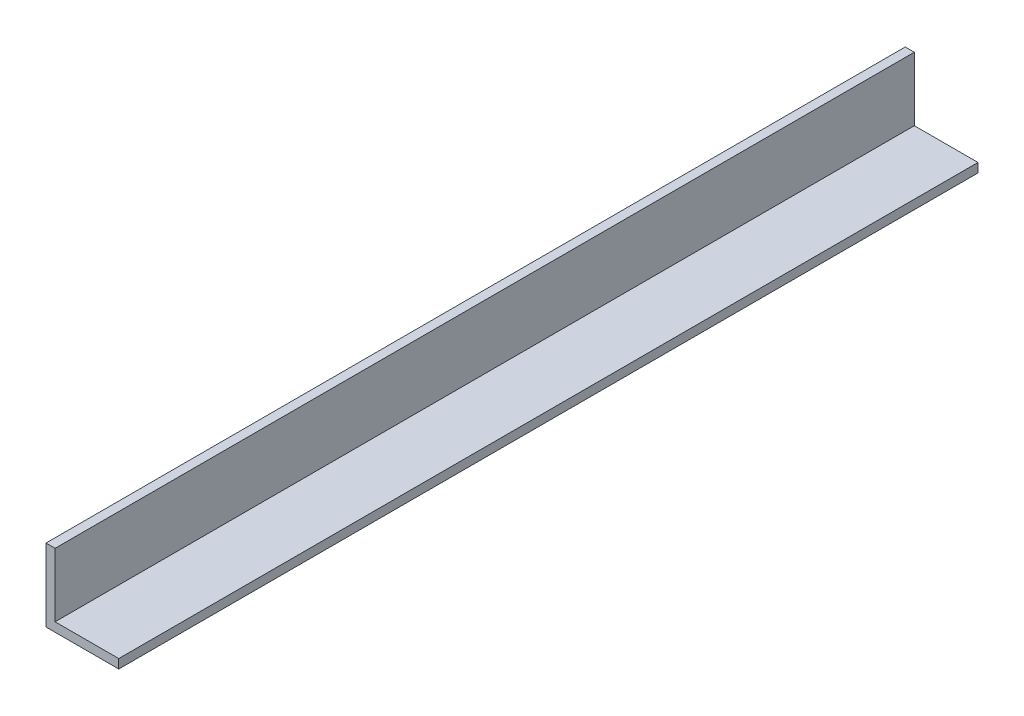
ISO-10303-21;
HEADER;
FILE_DESCRIPTION(('STEP AP214'),'2;1');
FILE_NAME('part.step','',(''),(''),'','','');
FILE_SCHEMA(('AUTOMOTIVE_DESIGN { 1 0 10303 214 1 1 1 1 }'));
ENDSEC;
DATA;
#1=APPLICATION_CONTEXT('core data for automotive mechanical design processes');
#2=APPLICATION_PROTOCOL_DEFINITION('international standard','automotive_design',2000,#1);
#3=PRODUCT_CONTEXT('',#1,'mechanical');
#4=PRODUCT('Part','Part','',(#3));
#5=PRODUCT_RELATED_PRODUCT_CATEGORY('part','',(#4));
#6=PRODUCT_DEFINITION_FORMATION('','',#4);
#7=PRODUCT_DEFINITION_CONTEXT('part definition',#1,'design');
#8=PRODUCT_DEFINITION('design','',#6,#7);
#9=PRODUCT_DEFINITION_SHAPE('','',#8);
#10=(LENGTH_UNIT() NAMED_UNIT(*) SI_UNIT(.MILLI.,.METRE.));
#11=(NAMED_UNIT(*) PLANE_ANGLE_UNIT() SI_UNIT($,.RADIAN.));
#12=(NAMED_UNIT(*) SI_UNIT($,.STERADIAN.) SOLID_ANGLE_UNIT());
#13=UNCERTAINTY_MEASURE_WITH_UNIT(LENGTH_MEASURE(1.E-05),#10,'distance_accuracy_value','');
#14=(GEOMETRIC_REPRESENTATION_CONTEXT(3) GLOBAL_UNCERTAINTY_ASSIGNED_CONTEXT((#13)) GLOBAL_UNIT_ASSIGNED_CONTEXT((#10,
#11,#12)) REPRESENTATION_CONTEXT('',''));
#15=CARTESIAN_POINT('',(0.,0.,0.));
#16=DIRECTION('',(0.,0.,1.));
#17=DIRECTION('',(1.,0.,0.));
#18=AXIS2_PLACEMENT_3D('',#15,#16,#17);
#19=CARTESIAN_POINT('',(3.175,25.4,150.));
#20=DIRECTION('',(0.,-1.,0.));
#21=DIRECTION('',(0.,0.,-1.));
#22=AXIS2_PLACEMENT_3D('',#19,#20,#21);
#23=PLANE('',#22);
#24=DIRECTION('',(-1.,0.,0.));
#25=VECTOR('',#24,1.);
#26=CARTESIAN_POINT('',(3.175,25.4,-150.));
#27=LINE('',#26,#25);
#28=CARTESIAN_POINT('',(3.175,25.4,-150.));
#29=VERTEX_POINT('',#28);
#30=CARTESIAN_POINT('',(0.,25.4,-150.));
#31=VERTEX_POINT('',#30);
#32=EDGE_CURVE('E127',#29,#31,#27,.T.);
#33=ORIENTED_EDGE('',*,*,#32,.T.);
#34=DIRECTION('',(0.,0.,-1.));
#35=VECTOR('',#34,1.);
#36=CARTESIAN_POINT('',(0.,25.4,150.));
#37=LINE('',#36,#35);
#38=CARTESIAN_POINT('',(0.,25.4,150.));
#39=VERTEX_POINT('',#38);
#40=EDGE_CURVE('E11',#39,#31,#37,.T.);
#41=ORIENTED_EDGE('',*,*,#40,.F.);
#42=DIRECTION('',(-1.,0.,0.));
#43=VECTOR('',#42,1.);
#44=CARTESIAN_POINT('',(3.175,25.4,150.));
#45=LINE('',#44,#43);
#46=CARTESIAN_POINT('',(3.175,25.4,150.));
#47=VERTEX_POINT('',#46);
#48=EDGE_CURVE('E137',#47,#39,#45,.T.);
#49=ORIENTED_EDGE('',*,*,#48,.F.);
#50=DIRECTION('',(0.,0.,-1.));
#51=VECTOR('',#50,1.);
#52=CARTESIAN_POINT('',(3.175,25.4,150.));
#53=LINE('',#52,#51);
#54=EDGE_CURVE('E123',#47,#29,#53,.T.);
#55=ORIENTED_EDGE('',*,*,#54,.T.);
#56=EDGE_LOOP('',(#33,#41,#49,#55));
#57=FACE_BOUND('',#56,.T.);
#58=ADVANCED_FACE('F43',(#57),#23,.F.);
#59=CARTESIAN_POINT('',(0.,25.4,150.));
#60=DIRECTION('',(1.,0.,0.));
#61=DIRECTION('',(0.,0.,-1.));
#62=AXIS2_PLACEMENT_3D('',#59,#60,#61);
#63=PLANE('',#62);
#64=DIRECTION('',(0.,-1.,0.));
#65=VECTOR('',#64,1.);
#66=CARTESIAN_POINT('',(0.,25.4,-150.));
#67=LINE('',#66,#65);
#68=CARTESIAN_POINT('',(0.,0.,-150.));
#69=VERTEX_POINT('',#68);
#70=EDGE_CURVE('E130',#31,#69,#67,.T.);
#71=ORIENTED_EDGE('',*,*,#70,.T.);
#72=DIRECTION('',(0.,0.,-1.));
#73=VECTOR('',#72,1.);
#74=CARTESIAN_POINT('',(0.,0.,150.));
#75=LINE('',#74,#73);
#76=CARTESIAN_POINT('',(0.,0.,150.));
#77=VERTEX_POINT('',#76);
#78=EDGE_CURVE('E51',#77,#69,#75,.T.);
#79=ORIENTED_EDGE('',*,*,#78,.F.);
#80=DIRECTION('',(0.,-1.,0.));
#81=VECTOR('',#80,1.);
#82=CARTESIAN_POINT('',(0.,25.4,150.));
#83=LINE('',#82,#81);
#84=EDGE_CURVE('E96',#39,#77,#83,.T.);
#85=ORIENTED_EDGE('',*,*,#84,.F.);
#86=ORIENTED_EDGE('',*,*,#40,.T.);
#87=EDGE_LOOP('',(#71,#79,#85,#86));
#88=FACE_BOUND('',#87,.T.);
#89=ADVANCED_FACE('F161',(#88),#63,.F.);
#90=CARTESIAN_POINT('',(0.,0.,150.));
#91=DIRECTION('',(0.,1.,0.));
#92=DIRECTION('',(0.,0.,1.));
#93=AXIS2_PLACEMENT_3D('',#90,#91,#92);
#94=PLANE('',#93);
#95=DIRECTION('',(1.,0.,0.));
#96=VECTOR('',#95,1.);
#97=CARTESIAN_POINT('',(0.,0.,-150.));
#98=LINE('',#97,#96);
#99=CARTESIAN_POINT('',(25.4,0.,-150.));
#100=VERTEX_POINT('',#99);
#101=EDGE_CURVE('E132',#69,#100,#98,.T.);
#102=ORIENTED_EDGE('',*,*,#101,.T.);
#103=DIRECTION('',(0.,0.,-1.));
#104=VECTOR('',#103,1.);
#105=CARTESIAN_POINT('',(25.4,0.,150.));
#106=LINE('',#105,#104);
#107=CARTESIAN_POINT('',(25.4,0.,150.));
#108=VERTEX_POINT('',#107);
#109=EDGE_CURVE('E118',#108,#100,#106,.T.);
#110=ORIENTED_EDGE('',*,*,#109,.F.);
#111=DIRECTION('',(1.,0.,0.));
#112=VECTOR('',#111,1.);
#113=CARTESIAN_POINT('',(0.,0.,150.));
#114=LINE('',#113,#112);
#115=EDGE_CURVE('E109',#77,#108,#114,.T.);
#116=ORIENTED_EDGE('',*,*,#115,.F.);
#117=ORIENTED_EDGE('',*,*,#78,.T.);
#118=EDGE_LOOP('',(#102,#110,#116,#117));
#119=FACE_BOUND('',#118,.T.);
#120=ADVANCED_FACE('F143',(#119),#94,.F.);
#121=CARTESIAN_POINT('',(25.4,0.,150.));
#122=DIRECTION('',(-1.,0.,0.));
#123=DIRECTION('',(0.,0.,1.));
#124=AXIS2_PLACEMENT_3D('',#121,#122,#123);
#125=PLANE('',#124);
#126=DIRECTION('',(0.,1.,0.));
#127=VECTOR('',#126,1.);
#128=CARTESIAN_POINT('',(25.4,0.,-150.));
#129=LINE('',#128,#127);
#130=CARTESIAN_POINT('',(25.4,3.175,-150.));
#131=VERTEX_POINT('',#130);
#132=EDGE_CURVE('E117',#100,#131,#129,.T.);
#133=ORIENTED_EDGE('',*,*,#132,.T.);
#134=DIRECTION('',(0.,0.,-1.));
#135=VECTOR('',#134,1.);
#136=CARTESIAN_POINT('',(25.4,3.175,150.));
#137=LINE('',#136,#135);
#138=CARTESIAN_POINT('',(25.4,3.175,150.));
#139=VERTEX_POINT('',#138);
#140=EDGE_CURVE('E114',#139,#131,#137,.T.);
#141=ORIENTED_EDGE('',*,*,#140,.F.);
#142=DIRECTION('',(0.,1.,0.));
#143=VECTOR('',#142,1.);
#144=CARTESIAN_POINT('',(25.4,0.,150.));
#145=LINE('',#144,#143);
#146=EDGE_CURVE('E103',#108,#139,#145,.T.);
#147=ORIENTED_EDGE('',*,*,#146,.F.);
#148=ORIENTED_EDGE('',*,*,#109,.T.);
#149=EDGE_LOOP('',(#133,#141,#147,#148));
#150=FACE_BOUND('',#149,.T.);
#151=ADVANCED_FACE('F115',(#150),#125,.F.);
#152=CARTESIAN_POINT('',(25.4,3.175,150.));
#153=DIRECTION('',(0.,-1.,0.));
#154=DIRECTION('',(0.,0.,-1.));
#155=AXIS2_PLACEMENT_3D('',#152,#153,#154);
#156=PLANE('',#155);
#157=DIRECTION('',(-1.,0.,0.));
#158=VECTOR('',#157,1.);
#159=CARTESIAN_POINT('',(25.4,3.175,-150.));
#160=LINE('',#159,#158);
#161=CARTESIAN_POINT('',(3.175,3.175,-150.));
#162=VERTEX_POINT('',#161);
#163=EDGE_CURVE('E82',#131,#162,#160,.T.);
#164=ORIENTED_EDGE('',*,*,#163,.T.);
#165=DIRECTION('',(0.,0.,-1.));
#166=VECTOR('',#165,1.);
#167=CARTESIAN_POINT('',(3.175,3.175,150.));
#168=LINE('',#167,#166);
#169=CARTESIAN_POINT('',(3.175,3.175,150.));
#170=VERTEX_POINT('',#169);
#171=EDGE_CURVE('E119',#170,#162,#168,.T.);
#172=ORIENTED_EDGE('',*,*,#171,.F.);
#173=DIRECTION('',(-1.,0.,0.));
#174=VECTOR('',#173,1.);
#175=CARTESIAN_POINT('',(25.4,3.175,150.));
#176=LINE('',#175,#174);
#177=EDGE_CURVE('E107',#139,#170,#176,.T.);
#178=ORIENTED_EDGE('',*,*,#177,.F.);
#179=ORIENTED_EDGE('',*,*,#140,.T.);
#180=EDGE_LOOP('',(#164,#172,#178,#179));
#181=FACE_BOUND('',#180,.T.);
#182=ADVANCED_FACE('F121',(#181),#156,.F.);
#183=CARTESIAN_POINT('',(3.175,3.175,150.));
#184=DIRECTION('',(-1.,0.,0.));
#185=DIRECTION('',(0.,0.,1.));
#186=AXIS2_PLACEMENT_3D('',#183,#184,#185);
#187=PLANE('',#186);
#188=DIRECTION('',(0.,1.,0.));
#189=VECTOR('',#188,1.);
#190=CARTESIAN_POINT('',(3.175,3.175,-150.));
#191=LINE('',#190,#189);
#192=EDGE_CURVE('E88',#162,#29,#191,.T.);
#193=ORIENTED_EDGE('',*,*,#192,.T.);
#194=ORIENTED_EDGE('',*,*,#54,.F.);
#195=DIRECTION('',(0.,1.,0.));
#196=VECTOR('',#195,1.);
#197=CARTESIAN_POINT('',(3.175,3.175,150.));
#198=LINE('',#197,#196);
#199=EDGE_CURVE('E59',#170,#47,#198,.T.);
#200=ORIENTED_EDGE('',*,*,#199,.F.);
#201=ORIENTED_EDGE('',*,*,#171,.T.);
#202=EDGE_LOOP('',(#193,#194,#200,#201));
#203=FACE_BOUND('',#202,.T.);
#204=ADVANCED_FACE('F150',(#203),#187,.F.);
#205=CARTESIAN_POINT('',(0.,0.,150.));
#206=DIRECTION('',(0.,0.,1.));
#207=DIRECTION('',(1.,0.,0.));
#208=AXIS2_PLACEMENT_3D('',#205,#206,#207);
#209=PLANE('',#208);
#210=ORIENTED_EDGE('',*,*,#48,.T.);
#211=ORIENTED_EDGE('',*,*,#84,.T.);
#212=ORIENTED_EDGE('',*,*,#115,.T.);
#213=ORIENTED_EDGE('',*,*,#146,.T.);
#214=ORIENTED_EDGE('',*,*,#177,.T.);
#215=ORIENTED_EDGE('',*,*,#199,.T.);
#216=EDGE_LOOP('',(#210,#211,#212,#213,#214,#215));
#217=FACE_BOUND('',#216,.T.);
#218=ADVANCED_FACE('F105',(#217),#209,.T.);
#219=CARTESIAN_POINT('',(0.,0.,-150.));
#220=DIRECTION('',(0.,0.,1.));
#221=DIRECTION('',(1.,0.,0.));
#222=AXIS2_PLACEMENT_3D('',#219,#220,#221);
#223=PLANE('',#222);
#224=ORIENTED_EDGE('',*,*,#32,.F.);
#225=ORIENTED_EDGE('',*,*,#192,.F.);
#226=ORIENTED_EDGE('',*,*,#163,.F.);
#227=ORIENTED_EDGE('',*,*,#132,.F.);
#228=ORIENTED_EDGE('',*,*,#101,.F.);
#229=ORIENTED_EDGE('',*,*,#70,.F.);
#230=EDGE_LOOP('',(#224,#225,#226,#227,#228,#229));
#231=FACE_BOUND('',#230,.T.);
#232=ADVANCED_FACE('F146',(#231),#223,.F.);
#233=CLOSED_SHELL('',(#58,#89,#120,#151,#182,#204,#218,#232));
#234=MANIFOLD_SOLID_BREP('B2',#233);
#235=ADVANCED_BREP_SHAPE_REPRESENTATION('',(#18,#234),#14);
#236=SHAPE_DEFINITION_REPRESENTATION(#9,#235);
ENDSEC;
END-ISO-10303-21;
